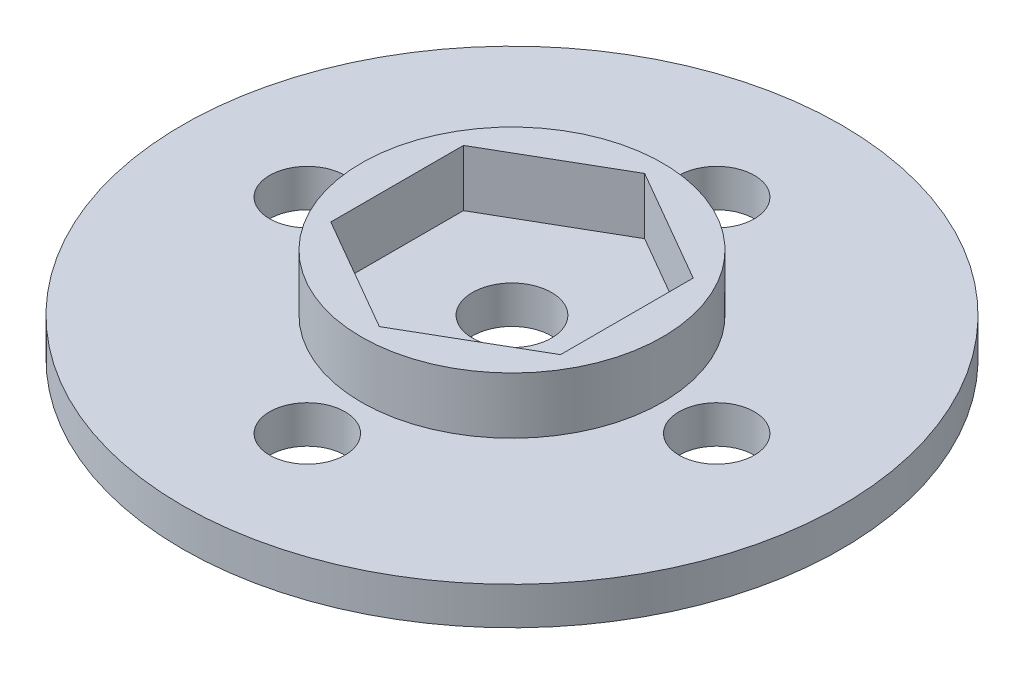
ISO-10303-21;
HEADER;
FILE_DESCRIPTION(('STEP AP214'),'2;1');
FILE_NAME('part.step','',(''),(''),'','','');
FILE_SCHEMA(('AUTOMOTIVE_DESIGN { 1 0 10303 214 1 1 1 1 }'));
ENDSEC;
DATA;
#1=APPLICATION_CONTEXT('core data for automotive mechanical design processes');
#2=APPLICATION_PROTOCOL_DEFINITION('international standard','automotive_design',2000,#1);
#3=PRODUCT_CONTEXT('',#1,'mechanical');
#4=PRODUCT('Part','Part','',(#3));
#5=PRODUCT_RELATED_PRODUCT_CATEGORY('part','',(#4));
#6=PRODUCT_DEFINITION_FORMATION('','',#4);
#7=PRODUCT_DEFINITION_CONTEXT('part definition',#1,'design');
#8=PRODUCT_DEFINITION('design','',#6,#7);
#9=PRODUCT_DEFINITION_SHAPE('','',#8);
#10=(LENGTH_UNIT() NAMED_UNIT(*) SI_UNIT(.MILLI.,.METRE.));
#11=(NAMED_UNIT(*) PLANE_ANGLE_UNIT() SI_UNIT($,.RADIAN.));
#12=(NAMED_UNIT(*) SI_UNIT($,.STERADIAN.) SOLID_ANGLE_UNIT());
#13=UNCERTAINTY_MEASURE_WITH_UNIT(LENGTH_MEASURE(1.E-05),#10,'distance_accuracy_value','');
#14=(GEOMETRIC_REPRESENTATION_CONTEXT(3) GLOBAL_UNCERTAINTY_ASSIGNED_CONTEXT((#13)) GLOBAL_UNIT_ASSIGNED_CONTEXT((#10,
#11,#12)) REPRESENTATION_CONTEXT('',''));
#15=CARTESIAN_POINT('',(0.,0.,0.));
#16=DIRECTION('',(0.,0.,1.));
#17=DIRECTION('',(1.,0.,0.));
#18=AXIS2_PLACEMENT_3D('',#15,#16,#17);
#19=CARTESIAN_POINT('',(0.,2.,10.87));
#20=DIRECTION('',(0.,-1.,0.));
#21=DIRECTION('',(0.,0.,-1.));
#22=AXIS2_PLACEMENT_3D('',#19,#20,#21);
#23=CYLINDRICAL_SURFACE('',#22,2.);
#24=CARTESIAN_POINT('',(0.,2.,10.87));
#25=DIRECTION('',(0.,1.,0.));
#26=DIRECTION('',(0.,0.,1.));
#27=AXIS2_PLACEMENT_3D('',#24,#25,#26);
#28=CIRCLE('',#27,2.);
#29=CARTESIAN_POINT('',(0.,2.,12.87));
#30=VERTEX_POINT('',#29);
#31=EDGE_CURVE('E44',#30,#30,#28,.T.);
#32=ORIENTED_EDGE('',*,*,#31,.T.);
#33=EDGE_LOOP('',(#32));
#34=FACE_BOUND('',#33,.T.);
#35=CARTESIAN_POINT('',(0.,0.,10.87));
#36=DIRECTION('',(0.,1.,0.));
#37=DIRECTION('',(0.,0.,1.));
#38=AXIS2_PLACEMENT_3D('',#35,#36,#37);
#39=CIRCLE('',#38,2.);
#40=CARTESIAN_POINT('',(0.,0.,12.87));
#41=VERTEX_POINT('',#40);
#42=EDGE_CURVE('E176',#41,#41,#39,.T.);
#43=ORIENTED_EDGE('',*,*,#42,.F.);
#44=EDGE_LOOP('',(#43));
#45=FACE_BOUND('',#44,.T.);
#46=ADVANCED_FACE('F35',(#34,#45),#23,.F.);
#47=CARTESIAN_POINT('',(-10.87,2.,0.));
#48=DIRECTION('',(0.,-1.,0.));
#49=DIRECTION('',(0.,0.,-1.));
#50=AXIS2_PLACEMENT_3D('',#47,#48,#49);
#51=CYLINDRICAL_SURFACE('',#50,2.);
#52=CARTESIAN_POINT('',(-10.87,2.,0.));
#53=DIRECTION('',(0.,1.,0.));
#54=DIRECTION('',(0.,0.,1.));
#55=AXIS2_PLACEMENT_3D('',#52,#53,#54);
#56=CIRCLE('',#55,2.);
#57=CARTESIAN_POINT('',(-10.87,2.,1.99999999999992));
#58=VERTEX_POINT('',#57);
#59=EDGE_CURVE('E163',#58,#58,#56,.T.);
#60=ORIENTED_EDGE('',*,*,#59,.T.);
#61=EDGE_LOOP('',(#60));
#62=FACE_BOUND('',#61,.T.);
#63=CARTESIAN_POINT('',(-10.87,0.,0.));
#64=DIRECTION('',(0.,1.,0.));
#65=DIRECTION('',(0.,0.,1.));
#66=AXIS2_PLACEMENT_3D('',#63,#64,#65);
#67=CIRCLE('',#66,2.);
#68=CARTESIAN_POINT('',(-10.87,0.,1.99999999999992));
#69=VERTEX_POINT('',#68);
#70=EDGE_CURVE('E173',#69,#69,#67,.T.);
#71=ORIENTED_EDGE('',*,*,#70,.F.);
#72=EDGE_LOOP('',(#71));
#73=FACE_BOUND('',#72,.T.);
#74=ADVANCED_FACE('F200',(#62,#73),#51,.F.);
#75=CARTESIAN_POINT('',(1.13857206459675E-13,2.,-10.87));
#76=DIRECTION('',(0.,-1.,0.));
#77=DIRECTION('',(0.,0.,-1.));
#78=AXIS2_PLACEMENT_3D('',#75,#76,#77);
#79=CYLINDRICAL_SURFACE('',#78,2.);
#80=CARTESIAN_POINT('',(1.13857206459675E-13,2.,-10.87));
#81=DIRECTION('',(0.,1.,0.));
#82=DIRECTION('',(0.,0.,1.));
#83=AXIS2_PLACEMENT_3D('',#80,#81,#82);
#84=CIRCLE('',#83,2.);
#85=CARTESIAN_POINT('',(1.13857206459675E-13,2.,-8.87));
#86=VERTEX_POINT('',#85);
#87=EDGE_CURVE('E159',#86,#86,#84,.T.);
#88=ORIENTED_EDGE('',*,*,#87,.T.);
#89=EDGE_LOOP('',(#88));
#90=FACE_BOUND('',#89,.T.);
#91=CARTESIAN_POINT('',(1.13857206459675E-13,0.,-10.87));
#92=DIRECTION('',(0.,1.,0.));
#93=DIRECTION('',(0.,0.,1.));
#94=AXIS2_PLACEMENT_3D('',#91,#92,#93);
#95=CIRCLE('',#94,2.);
#96=CARTESIAN_POINT('',(1.13857206459675E-13,0.,-8.87));
#97=VERTEX_POINT('',#96);
#98=EDGE_CURVE('E170',#97,#97,#95,.T.);
#99=ORIENTED_EDGE('',*,*,#98,.F.);
#100=EDGE_LOOP('',(#99));
#101=FACE_BOUND('',#100,.T.);
#102=ADVANCED_FACE('F206',(#90,#101),#79,.F.);
#103=CARTESIAN_POINT('',(10.87,2.,0.));
#104=DIRECTION('',(0.,-1.,0.));
#105=DIRECTION('',(0.,0.,-1.));
#106=AXIS2_PLACEMENT_3D('',#103,#104,#105);
#107=CYLINDRICAL_SURFACE('',#106,2.);
#108=CARTESIAN_POINT('',(10.87,2.,0.));
#109=DIRECTION('',(0.,1.,0.));
#110=DIRECTION('',(0.,0.,1.));
#111=AXIS2_PLACEMENT_3D('',#108,#109,#110);
#112=CIRCLE('',#111,2.);
#113=CARTESIAN_POINT('',(10.87,2.,2.));
#114=VERTEX_POINT('',#113);
#115=EDGE_CURVE('E156',#114,#114,#112,.T.);
#116=ORIENTED_EDGE('',*,*,#115,.T.);
#117=EDGE_LOOP('',(#116));
#118=FACE_BOUND('',#117,.T.);
#119=CARTESIAN_POINT('',(10.87,0.,0.));
#120=DIRECTION('',(0.,1.,0.));
#121=DIRECTION('',(0.,0.,1.));
#122=AXIS2_PLACEMENT_3D('',#119,#120,#121);
#123=CIRCLE('',#122,2.);
#124=CARTESIAN_POINT('',(10.87,0.,2.));
#125=VERTEX_POINT('',#124);
#126=EDGE_CURVE('E155',#125,#125,#123,.T.);
#127=ORIENTED_EDGE('',*,*,#126,.F.);
#128=EDGE_LOOP('',(#127));
#129=FACE_BOUND('',#128,.T.);
#130=ADVANCED_FACE('F37',(#118,#129),#107,.F.);
#131=CARTESIAN_POINT('',(0.,2.,0.));
#132=DIRECTION('',(0.,-1.,0.));
#133=DIRECTION('',(0.,0.,-1.));
#134=AXIS2_PLACEMENT_3D('',#131,#132,#133);
#135=CYLINDRICAL_SURFACE('',#134,17.5);
#136=CARTESIAN_POINT('',(0.,2.,0.));
#137=DIRECTION('',(0.,1.,0.));
#138=DIRECTION('',(0.,0.,1.));
#139=AXIS2_PLACEMENT_3D('',#136,#137,#138);
#140=CIRCLE('',#139,17.5);
#141=CARTESIAN_POINT('',(0.,2.,17.5));
#142=VERTEX_POINT('',#141);
#143=EDGE_CURVE('E11',#142,#142,#140,.T.);
#144=ORIENTED_EDGE('',*,*,#143,.F.);
#145=EDGE_LOOP('',(#144));
#146=FACE_BOUND('',#145,.T.);
#147=CARTESIAN_POINT('',(0.,0.,0.));
#148=DIRECTION('',(0.,1.,0.));
#149=DIRECTION('',(0.,0.,1.));
#150=AXIS2_PLACEMENT_3D('',#147,#148,#149);
#151=CIRCLE('',#150,17.5);
#152=CARTESIAN_POINT('',(0.,0.,17.5));
#153=VERTEX_POINT('',#152);
#154=EDGE_CURVE('E160',#153,#153,#151,.T.);
#155=ORIENTED_EDGE('',*,*,#154,.T.);
#156=EDGE_LOOP('',(#155));
#157=FACE_BOUND('',#156,.T.);
#158=ADVANCED_FACE('F181',(#146,#157),#135,.T.);
#159=CARTESIAN_POINT('',(0.,2.,0.));
#160=DIRECTION('',(0.,1.,0.));
#161=DIRECTION('',(0.,0.,1.));
#162=AXIS2_PLACEMENT_3D('',#159,#160,#161);
#163=PLANE('',#162);
#164=CARTESIAN_POINT('',(0.,2.,0.));
#165=DIRECTION('',(0.,1.,0.));
#166=DIRECTION('',(0.,0.,1.));
#167=AXIS2_PLACEMENT_3D('',#164,#165,#166);
#168=CIRCLE('',#167,8.);
#169=CARTESIAN_POINT('',(0.,2.,8.));
#170=VERTEX_POINT('',#169);
#171=EDGE_CURVE('E97',#170,#170,#168,.F.);
#172=ORIENTED_EDGE('',*,*,#171,.T.);
#173=EDGE_LOOP('',(#172));
#174=FACE_BOUND('',#173,.T.);
#175=ORIENTED_EDGE('',*,*,#115,.F.);
#176=EDGE_LOOP('',(#175));
#177=FACE_BOUND('',#176,.T.);
#178=ORIENTED_EDGE('',*,*,#87,.F.);
#179=EDGE_LOOP('',(#178));
#180=FACE_BOUND('',#179,.T.);
#181=ORIENTED_EDGE('',*,*,#59,.F.);
#182=EDGE_LOOP('',(#181));
#183=FACE_BOUND('',#182,.T.);
#184=ORIENTED_EDGE('',*,*,#31,.F.);
#185=EDGE_LOOP('',(#184));
#186=FACE_BOUND('',#185,.T.);
#187=ORIENTED_EDGE('',*,*,#143,.T.);
#188=EDGE_LOOP('',(#187));
#189=FACE_BOUND('',#188,.T.);
#190=ADVANCED_FACE('F185',(#174,#177,#180,#183,#186,#189),#163,.T.);
#191=CARTESIAN_POINT('',(0.,0.,0.));
#192=DIRECTION('',(0.,1.,0.));
#193=DIRECTION('',(0.,0.,1.));
#194=AXIS2_PLACEMENT_3D('',#191,#192,#193);
#195=PLANE('',#194);
#196=CARTESIAN_POINT('',(0.,0.,0.));
#197=DIRECTION('',(0.,1.,0.));
#198=DIRECTION('',(0.,0.,1.));
#199=AXIS2_PLACEMENT_3D('',#196,#197,#198);
#200=CIRCLE('',#199,2.1);
#201=CARTESIAN_POINT('',(0.,0.,2.1));
#202=VERTEX_POINT('',#201);
#203=EDGE_CURVE('E110',#202,#202,#200,.T.);
#204=ORIENTED_EDGE('',*,*,#203,.T.);
#205=EDGE_LOOP('',(#204));
#206=FACE_BOUND('',#205,.T.);
#207=ORIENTED_EDGE('',*,*,#126,.T.);
#208=EDGE_LOOP('',(#207));
#209=FACE_BOUND('',#208,.T.);
#210=ORIENTED_EDGE('',*,*,#98,.T.);
#211=EDGE_LOOP('',(#210));
#212=FACE_BOUND('',#211,.T.);
#213=ORIENTED_EDGE('',*,*,#70,.T.);
#214=EDGE_LOOP('',(#213));
#215=FACE_BOUND('',#214,.T.);
#216=ORIENTED_EDGE('',*,*,#42,.T.);
#217=EDGE_LOOP('',(#216));
#218=FACE_BOUND('',#217,.T.);
#219=ORIENTED_EDGE('',*,*,#154,.F.);
#220=EDGE_LOOP('',(#219));
#221=FACE_BOUND('',#220,.T.);
#222=ADVANCED_FACE('F183',(#206,#209,#212,#215,#218,#221),#195,.F.);
#223=CARTESIAN_POINT('',(3.05,5.,-5.28275496308508));
#224=DIRECTION('',(-0.5,0.,0.866025403784438));
#225=DIRECTION('',(0.866025403784438,0.,0.5));
#226=AXIS2_PLACEMENT_3D('',#223,#224,#225);
#227=PLANE('',#226);
#228=DIRECTION('',(0.,-1.,0.));
#229=VECTOR('',#228,1.);
#230=CARTESIAN_POINT('',(0.,5.,-7.04367328411344));
#231=LINE('',#230,#229);
#232=CARTESIAN_POINT('',(0.,5.,-7.04367328411344));
#233=VERTEX_POINT('',#232);
#234=CARTESIAN_POINT('',(0.,2.,-7.04367328411344));
#235=VERTEX_POINT('',#234);
#236=EDGE_CURVE('E129',#233,#235,#231,.T.);
#237=ORIENTED_EDGE('',*,*,#236,.T.);
#238=DIRECTION('',(0.866025403784438,0.,0.5));
#239=VECTOR('',#238,1.);
#240=CARTESIAN_POINT('',(3.05,2.,-5.28275496308508));
#241=LINE('',#240,#239);
#242=CARTESIAN_POINT('',(6.1,2.,-3.52183664205672));
#243=VERTEX_POINT('',#242);
#244=EDGE_CURVE('E94',#235,#243,#241,.T.);
#245=ORIENTED_EDGE('',*,*,#244,.T.);
#246=DIRECTION('',(0.,-1.,0.));
#247=VECTOR('',#246,1.);
#248=CARTESIAN_POINT('',(6.1,5.,-3.52183664205672));
#249=LINE('',#248,#247);
#250=CARTESIAN_POINT('',(6.1,5.,-3.52183664205672));
#251=VERTEX_POINT('',#250);
#252=EDGE_CURVE('E88',#251,#243,#249,.T.);
#253=ORIENTED_EDGE('',*,*,#252,.F.);
#254=DIRECTION('',(-0.866025403784439,0.,-0.5));
#255=VECTOR('',#254,1.);
#256=CARTESIAN_POINT('',(3.05,5.,-5.28275496308508));
#257=LINE('',#256,#255);
#258=EDGE_CURVE('E92',#251,#233,#257,.T.);
#259=ORIENTED_EDGE('',*,*,#258,.T.);
#260=EDGE_LOOP('',(#237,#245,#253,#259));
#261=FACE_BOUND('',#260,.T.);
#262=ADVANCED_FACE('F91',(#261),#227,.T.);
#263=CARTESIAN_POINT('',(6.1,5.,0.));
#264=DIRECTION('',(-1.,0.,0.));
#265=DIRECTION('',(0.,0.,1.));
#266=AXIS2_PLACEMENT_3D('',#263,#264,#265);
#267=PLANE('',#266);
#268=ORIENTED_EDGE('',*,*,#252,.T.);
#269=DIRECTION('',(0.,0.,1.));
#270=VECTOR('',#269,1.);
#271=CARTESIAN_POINT('',(6.1,2.,0.));
#272=LINE('',#271,#270);
#273=CARTESIAN_POINT('',(6.1,2.,3.52183664205672));
#274=VERTEX_POINT('',#273);
#275=EDGE_CURVE('E52',#243,#274,#272,.T.);
#276=ORIENTED_EDGE('',*,*,#275,.T.);
#277=DIRECTION('',(0.,-1.,0.));
#278=VECTOR('',#277,1.);
#279=CARTESIAN_POINT('',(6.1,5.,3.52183664205672));
#280=LINE('',#279,#278);
#281=CARTESIAN_POINT('',(6.1,5.,3.52183664205672));
#282=VERTEX_POINT('',#281);
#283=EDGE_CURVE('E98',#282,#274,#280,.T.);
#284=ORIENTED_EDGE('',*,*,#283,.F.);
#285=DIRECTION('',(0.,0.,-1.));
#286=VECTOR('',#285,1.);
#287=CARTESIAN_POINT('',(6.1,5.,0.));
#288=LINE('',#287,#286);
#289=EDGE_CURVE('E105',#282,#251,#288,.T.);
#290=ORIENTED_EDGE('',*,*,#289,.T.);
#291=EDGE_LOOP('',(#268,#276,#284,#290));
#292=FACE_BOUND('',#291,.T.);
#293=ADVANCED_FACE('F112',(#292),#267,.T.);
#294=CARTESIAN_POINT('',(3.05,5.,5.28275496308508));
#295=DIRECTION('',(-0.5,0.,-0.866025403784439));
#296=DIRECTION('',(-0.866025403784439,0.,0.5));
#297=AXIS2_PLACEMENT_3D('',#294,#295,#296);
#298=PLANE('',#297);
#299=ORIENTED_EDGE('',*,*,#283,.T.);
#300=DIRECTION('',(-0.866025403784439,0.,0.5));
#301=VECTOR('',#300,1.);
#302=CARTESIAN_POINT('',(3.05,2.,5.28275496308508));
#303=LINE('',#302,#301);
#304=CARTESIAN_POINT('',(0.,2.,7.04367328411344));
#305=VERTEX_POINT('',#304);
#306=EDGE_CURVE('E57',#274,#305,#303,.T.);
#307=ORIENTED_EDGE('',*,*,#306,.T.);
#308=DIRECTION('',(0.,-1.,0.));
#309=VECTOR('',#308,1.);
#310=CARTESIAN_POINT('',(0.,5.,7.04367328411344));
#311=LINE('',#310,#309);
#312=CARTESIAN_POINT('',(0.,5.,7.04367328411344));
#313=VERTEX_POINT('',#312);
#314=EDGE_CURVE('E137',#313,#305,#311,.T.);
#315=ORIENTED_EDGE('',*,*,#314,.F.);
#316=DIRECTION('',(0.866025403784439,0.,-0.5));
#317=VECTOR('',#316,1.);
#318=CARTESIAN_POINT('',(3.05,5.,5.28275496308508));
#319=LINE('',#318,#317);
#320=EDGE_CURVE('E114',#313,#282,#319,.T.);
#321=ORIENTED_EDGE('',*,*,#320,.T.);
#322=EDGE_LOOP('',(#299,#307,#315,#321));
#323=FACE_BOUND('',#322,.T.);
#324=ADVANCED_FACE('F259',(#323),#298,.T.);
#325=CARTESIAN_POINT('',(-3.05,5.,5.28275496308508));
#326=DIRECTION('',(0.5,0.,-0.866025403784439));
#327=DIRECTION('',(-0.866025403784439,0.,-0.5));
#328=AXIS2_PLACEMENT_3D('',#325,#326,#327);
#329=PLANE('',#328);
#330=ORIENTED_EDGE('',*,*,#314,.T.);
#331=DIRECTION('',(-0.866025403784439,0.,-0.5));
#332=VECTOR('',#331,1.);
#333=CARTESIAN_POINT('',(-3.05,2.,5.28275496308508));
#334=LINE('',#333,#332);
#335=CARTESIAN_POINT('',(-6.1,2.,3.52183664205672));
#336=VERTEX_POINT('',#335);
#337=EDGE_CURVE('E149',#305,#336,#334,.T.);
#338=ORIENTED_EDGE('',*,*,#337,.T.);
#339=DIRECTION('',(0.,-1.,0.));
#340=VECTOR('',#339,1.);
#341=CARTESIAN_POINT('',(-6.1,5.,3.52183664205672));
#342=LINE('',#341,#340);
#343=CARTESIAN_POINT('',(-6.1,5.,3.52183664205672));
#344=VERTEX_POINT('',#343);
#345=EDGE_CURVE('E134',#344,#336,#342,.T.);
#346=ORIENTED_EDGE('',*,*,#345,.F.);
#347=DIRECTION('',(0.866025403784439,0.,0.5));
#348=VECTOR('',#347,1.);
#349=CARTESIAN_POINT('',(-3.05,5.,5.28275496308508));
#350=LINE('',#349,#348);
#351=EDGE_CURVE('E116',#344,#313,#350,.T.);
#352=ORIENTED_EDGE('',*,*,#351,.T.);
#353=EDGE_LOOP('',(#330,#338,#346,#352));
#354=FACE_BOUND('',#353,.T.);
#355=ADVANCED_FACE('F268',(#354),#329,.T.);
#356=CARTESIAN_POINT('',(-6.1,5.,0.));
#357=DIRECTION('',(1.,0.,0.));
#358=DIRECTION('',(0.,0.,-1.));
#359=AXIS2_PLACEMENT_3D('',#356,#357,#358);
#360=PLANE('',#359);
#361=ORIENTED_EDGE('',*,*,#345,.T.);
#362=DIRECTION('',(0.,0.,-1.));
#363=VECTOR('',#362,1.);
#364=CARTESIAN_POINT('',(-6.1,2.,0.));
#365=LINE('',#364,#363);
#366=CARTESIAN_POINT('',(-6.1,2.,-3.52183664205672));
#367=VERTEX_POINT('',#366);
#368=EDGE_CURVE('E146',#336,#367,#365,.T.);
#369=ORIENTED_EDGE('',*,*,#368,.T.);
#370=DIRECTION('',(0.,-1.,0.));
#371=VECTOR('',#370,1.);
#372=CARTESIAN_POINT('',(-6.1,5.,-3.52183664205672));
#373=LINE('',#372,#371);
#374=CARTESIAN_POINT('',(-6.1,5.,-3.52183664205672));
#375=VERTEX_POINT('',#374);
#376=EDGE_CURVE('E131',#375,#367,#373,.T.);
#377=ORIENTED_EDGE('',*,*,#376,.F.);
#378=DIRECTION('',(0.,0.,1.));
#379=VECTOR('',#378,1.);
#380=CARTESIAN_POINT('',(-6.1,5.,0.));
#381=LINE('',#380,#379);
#382=EDGE_CURVE('E122',#375,#344,#381,.T.);
#383=ORIENTED_EDGE('',*,*,#382,.T.);
#384=EDGE_LOOP('',(#361,#369,#377,#383));
#385=FACE_BOUND('',#384,.T.);
#386=ADVANCED_FACE('F278',(#385),#360,.T.);
#387=CARTESIAN_POINT('',(-3.05,5.,-5.28275496308507));
#388=DIRECTION('',(0.5,0.,0.866025403784438));
#389=DIRECTION('',(0.866025403784438,0.,-0.5));
#390=AXIS2_PLACEMENT_3D('',#387,#388,#389);
#391=PLANE('',#390);
#392=ORIENTED_EDGE('',*,*,#376,.T.);
#393=DIRECTION('',(0.866025403784438,0.,-0.5));
#394=VECTOR('',#393,1.);
#395=CARTESIAN_POINT('',(-3.05,2.,-5.28275496308507));
#396=LINE('',#395,#394);
#397=EDGE_CURVE('E143',#367,#235,#396,.T.);
#398=ORIENTED_EDGE('',*,*,#397,.T.);
#399=ORIENTED_EDGE('',*,*,#236,.F.);
#400=DIRECTION('',(-0.866025403784438,0.,0.5));
#401=VECTOR('',#400,1.);
#402=CARTESIAN_POINT('',(-3.05,5.,-5.28275496308507));
#403=LINE('',#402,#401);
#404=EDGE_CURVE('E109',#233,#375,#403,.T.);
#405=ORIENTED_EDGE('',*,*,#404,.T.);
#406=EDGE_LOOP('',(#392,#398,#399,#405));
#407=FACE_BOUND('',#406,.T.);
#408=ADVANCED_FACE('F288',(#407),#391,.T.);
#409=CARTESIAN_POINT('',(0.,5.,0.));
#410=DIRECTION('',(0.,-1.,0.));
#411=DIRECTION('',(0.,0.,-1.));
#412=AXIS2_PLACEMENT_3D('',#409,#410,#411);
#413=CYLINDRICAL_SURFACE('',#412,8.);
#414=ORIENTED_EDGE('',*,*,#171,.F.);
#415=EDGE_LOOP('',(#414));
#416=FACE_BOUND('',#415,.T.);
#417=CARTESIAN_POINT('',(0.,5.,0.));
#418=DIRECTION('',(0.,1.,0.));
#419=DIRECTION('',(0.,0.,1.));
#420=AXIS2_PLACEMENT_3D('',#417,#418,#419);
#421=CIRCLE('',#420,8.);
#422=CARTESIAN_POINT('',(0.,5.,8.));
#423=VERTEX_POINT('',#422);
#424=EDGE_CURVE('E126',#423,#423,#421,.T.);
#425=ORIENTED_EDGE('',*,*,#424,.F.);
#426=EDGE_LOOP('',(#425));
#427=FACE_BOUND('',#426,.T.);
#428=ADVANCED_FACE('F298',(#416,#427),#413,.T.);
#429=CARTESIAN_POINT('',(0.,5.,0.));
#430=DIRECTION('',(0.,1.,0.));
#431=DIRECTION('',(0.,0.,1.));
#432=AXIS2_PLACEMENT_3D('',#429,#430,#431);
#433=PLANE('',#432);
#434=ORIENTED_EDGE('',*,*,#258,.F.);
#435=ORIENTED_EDGE('',*,*,#289,.F.);
#436=ORIENTED_EDGE('',*,*,#320,.F.);
#437=ORIENTED_EDGE('',*,*,#351,.F.);
#438=ORIENTED_EDGE('',*,*,#382,.F.);
#439=ORIENTED_EDGE('',*,*,#404,.F.);
#440=EDGE_LOOP('',(#434,#435,#436,#437,#438,#439));
#441=FACE_BOUND('',#440,.T.);
#442=ORIENTED_EDGE('',*,*,#424,.T.);
#443=EDGE_LOOP('',(#442));
#444=FACE_BOUND('',#443,.T.);
#445=ADVANCED_FACE('F102',(#441,#444),#433,.T.);
#446=CARTESIAN_POINT('',(0.,2.,0.));
#447=DIRECTION('',(0.,1.,0.));
#448=DIRECTION('',(0.,0.,1.));
#449=AXIS2_PLACEMENT_3D('',#446,#447,#448);
#450=CIRCLE('',#449,2.1);
#451=CARTESIAN_POINT('',(0.,2.,2.1));
#452=VERTEX_POINT('',#451);
#453=EDGE_CURVE('E39',#452,#452,#450,.T.);
#454=ORIENTED_EDGE('',*,*,#453,.F.);
#455=EDGE_LOOP('',(#454));
#456=FACE_BOUND('',#455,.T.);
#457=ORIENTED_EDGE('',*,*,#244,.F.);
#458=ORIENTED_EDGE('',*,*,#397,.F.);
#459=ORIENTED_EDGE('',*,*,#368,.F.);
#460=ORIENTED_EDGE('',*,*,#337,.F.);
#461=ORIENTED_EDGE('',*,*,#306,.F.);
#462=ORIENTED_EDGE('',*,*,#275,.F.);
#463=EDGE_LOOP('',(#457,#458,#459,#460,#461,#462));
#464=FACE_BOUND('',#463,.T.);
#465=ADVANCED_FACE('F195',(#456,#464),#163,.T.);
#466=CARTESIAN_POINT('',(0.,-1.2E-05,0.));
#467=DIRECTION('',(0.,1.,0.));
#468=DIRECTION('',(0.,0.,1.));
#469=AXIS2_PLACEMENT_3D('',#466,#467,#468);
#470=CYLINDRICAL_SURFACE('',#469,2.1);
#471=ORIENTED_EDGE('',*,*,#453,.T.);
#472=EDGE_LOOP('',(#471));
#473=FACE_BOUND('',#472,.T.);
#474=ORIENTED_EDGE('',*,*,#203,.F.);
#475=EDGE_LOOP('',(#474));
#476=FACE_BOUND('',#475,.T.);
#477=ADVANCED_FACE('F328',(#473,#476),#470,.F.);
#478=CLOSED_SHELL('',(#46,#74,#102,#130,#158,#190,#222,#262,#293,#324,#355,#386,#408,#428,#445,
#465,#477));
#479=MANIFOLD_SOLID_BREP('B2',#478);
#480=ADVANCED_BREP_SHAPE_REPRESENTATION('',(#18,#479),#14);
#481=SHAPE_DEFINITION_REPRESENTATION(#9,#480);
ENDSEC;
END-ISO-10303-21;
